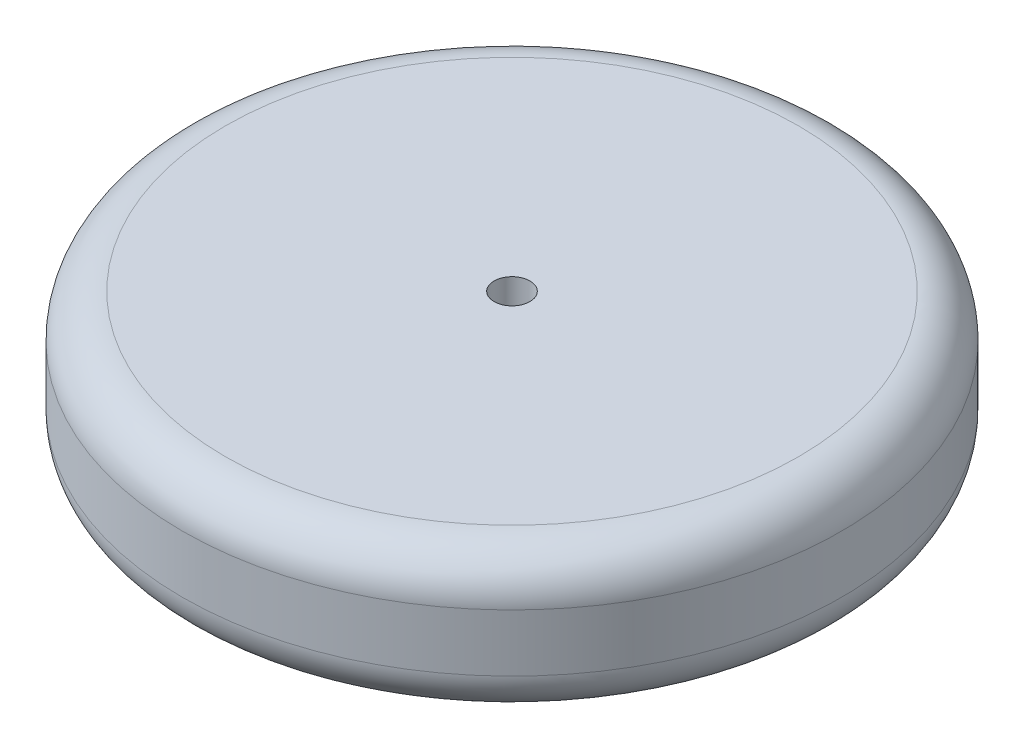
ISO-10303-21;
HEADER;
FILE_DESCRIPTION(('STEP AP214'),'2;1');
FILE_NAME('part.step','',(''),(''),'','','');
FILE_SCHEMA(('AUTOMOTIVE_DESIGN { 1 0 10303 214 1 1 1 1 }'));
ENDSEC;
DATA;
#1=APPLICATION_CONTEXT('core data for automotive mechanical design processes');
#2=APPLICATION_PROTOCOL_DEFINITION('international standard','automotive_design',2000,#1);
#3=PRODUCT_CONTEXT('',#1,'mechanical');
#4=PRODUCT('Part','Part','',(#3));
#5=PRODUCT_RELATED_PRODUCT_CATEGORY('part','',(#4));
#6=PRODUCT_DEFINITION_FORMATION('','',#4);
#7=PRODUCT_DEFINITION_CONTEXT('part definition',#1,'design');
#8=PRODUCT_DEFINITION('design','',#6,#7);
#9=PRODUCT_DEFINITION_SHAPE('','',#8);
#10=(LENGTH_UNIT() NAMED_UNIT(*) SI_UNIT(.MILLI.,.METRE.));
#11=(NAMED_UNIT(*) PLANE_ANGLE_UNIT() SI_UNIT($,.RADIAN.));
#12=(NAMED_UNIT(*) SI_UNIT($,.STERADIAN.) SOLID_ANGLE_UNIT());
#13=UNCERTAINTY_MEASURE_WITH_UNIT(LENGTH_MEASURE(1.E-05),#10,'distance_accuracy_value','');
#14=(GEOMETRIC_REPRESENTATION_CONTEXT(3) GLOBAL_UNCERTAINTY_ASSIGNED_CONTEXT((#13)) GLOBAL_UNIT_ASSIGNED_CONTEXT((#10,
#11,#12)) REPRESENTATION_CONTEXT('',''));
#15=CARTESIAN_POINT('',(0.,0.,0.));
#16=DIRECTION('',(0.,0.,1.));
#17=DIRECTION('',(1.,0.,0.));
#18=AXIS2_PLACEMENT_3D('',#15,#16,#17);
#19=CARTESIAN_POINT('',(0.,127.,0.));
#20=DIRECTION('',(0.,-1.,0.));
#21=DIRECTION('',(0.,0.,-1.));
#22=AXIS2_PLACEMENT_3D('',#19,#20,#21);
#23=CYLINDRICAL_SURFACE('',#22,292.1);
#24=CARTESIAN_POINT('',(0.,38.1,0.));
#25=DIRECTION('',(0.,1.,0.));
#26=DIRECTION('',(0.,0.,1.));
#27=AXIS2_PLACEMENT_3D('',#24,#25,#26);
#28=CIRCLE('',#27,292.1);
#29=CARTESIAN_POINT('',(0.,38.1,292.1));
#30=VERTEX_POINT('',#29);
#31=EDGE_CURVE('E59',#30,#30,#28,.T.);
#32=ORIENTED_EDGE('',*,*,#31,.T.);
#33=EDGE_LOOP('',(#32));
#34=FACE_BOUND('',#33,.T.);
#35=CARTESIAN_POINT('',(0.,88.9,0.));
#36=DIRECTION('',(0.,1.,0.));
#37=DIRECTION('',(0.,0.,1.));
#38=AXIS2_PLACEMENT_3D('',#35,#36,#37);
#39=CIRCLE('',#38,292.1);
#40=CARTESIAN_POINT('',(0.,88.9,292.1));
#41=VERTEX_POINT('',#40);
#42=EDGE_CURVE('E63',#41,#41,#39,.F.);
#43=ORIENTED_EDGE('',*,*,#42,.T.);
#44=EDGE_LOOP('',(#43));
#45=FACE_BOUND('',#44,.T.);
#46=ADVANCED_FACE('F48',(#34,#45),#23,.T.);
#47=CARTESIAN_POINT('',(0.,127.,0.));
#48=DIRECTION('',(0.,1.,0.));
#49=DIRECTION('',(0.,0.,1.));
#50=AXIS2_PLACEMENT_3D('',#47,#48,#49);
#51=PLANE('',#50);
#52=CARTESIAN_POINT('',(0.,127.,0.));
#53=DIRECTION('',(0.,1.,0.));
#54=DIRECTION('',(0.,0.,1.));
#55=AXIS2_PLACEMENT_3D('',#52,#53,#54);
#56=CIRCLE('',#55,15.875);
#57=CARTESIAN_POINT('',(0.,127.,15.875));
#58=VERTEX_POINT('',#57);
#59=EDGE_CURVE('E69',#58,#58,#56,.T.);
#60=ORIENTED_EDGE('',*,*,#59,.F.);
#61=EDGE_LOOP('',(#60));
#62=FACE_BOUND('',#61,.T.);
#63=CARTESIAN_POINT('',(0.,127.,0.));
#64=DIRECTION('',(0.,1.,0.));
#65=DIRECTION('',(0.,0.,1.));
#66=AXIS2_PLACEMENT_3D('',#63,#64,#65);
#67=CIRCLE('',#66,254.);
#68=CARTESIAN_POINT('',(0.,127.,254.));
#69=VERTEX_POINT('',#68);
#70=EDGE_CURVE('E12',#69,#69,#67,.T.);
#71=ORIENTED_EDGE('',*,*,#70,.T.);
#72=EDGE_LOOP('',(#71));
#73=FACE_BOUND('',#72,.T.);
#74=ADVANCED_FACE('F83',(#62,#73),#51,.T.);
#75=CARTESIAN_POINT('',(0.,0.,0.));
#76=DIRECTION('',(0.,1.,0.));
#77=DIRECTION('',(0.,0.,1.));
#78=AXIS2_PLACEMENT_3D('',#75,#76,#77);
#79=PLANE('',#78);
#80=CARTESIAN_POINT('',(0.,0.,0.));
#81=DIRECTION('',(0.,1.,0.));
#82=DIRECTION('',(0.,0.,1.));
#83=AXIS2_PLACEMENT_3D('',#80,#81,#82);
#84=CIRCLE('',#83,15.875);
#85=CARTESIAN_POINT('',(0.,0.,15.875));
#86=VERTEX_POINT('',#85);
#87=EDGE_CURVE('E68',#86,#86,#84,.T.);
#88=ORIENTED_EDGE('',*,*,#87,.T.);
#89=EDGE_LOOP('',(#88));
#90=FACE_BOUND('',#89,.T.);
#91=CARTESIAN_POINT('',(0.,0.,0.));
#92=DIRECTION('',(0.,1.,0.));
#93=DIRECTION('',(0.,0.,1.));
#94=AXIS2_PLACEMENT_3D('',#91,#92,#93);
#95=CIRCLE('',#94,254.);
#96=CARTESIAN_POINT('',(0.,0.,254.));
#97=VERTEX_POINT('',#96);
#98=EDGE_CURVE('E55',#97,#97,#95,.F.);
#99=ORIENTED_EDGE('',*,*,#98,.T.);
#100=EDGE_LOOP('',(#99));
#101=FACE_BOUND('',#100,.T.);
#102=ADVANCED_FACE('F75',(#90,#101),#79,.F.);
#103=CARTESIAN_POINT('',(0.,38.1,0.));
#104=DIRECTION('',(0.,1.,0.));
#105=DIRECTION('',(0.,0.,1.));
#106=AXIS2_PLACEMENT_3D('',#103,#104,#105);
#107=TOROIDAL_SURFACE('',#106,254.,38.1);
#108=ORIENTED_EDGE('',*,*,#98,.F.);
#109=EDGE_LOOP('',(#108));
#110=FACE_BOUND('',#109,.T.);
#111=ORIENTED_EDGE('',*,*,#31,.F.);
#112=EDGE_LOOP('',(#111));
#113=FACE_BOUND('',#112,.T.);
#114=ADVANCED_FACE('F90',(#110,#113),#107,.T.);
#115=CARTESIAN_POINT('',(0.,88.9,0.));
#116=DIRECTION('',(0.,1.,0.));
#117=DIRECTION('',(0.,0.,1.));
#118=AXIS2_PLACEMENT_3D('',#115,#116,#117);
#119=TOROIDAL_SURFACE('',#118,254.,38.1);
#120=ORIENTED_EDGE('',*,*,#42,.F.);
#121=EDGE_LOOP('',(#120));
#122=FACE_BOUND('',#121,.T.);
#123=ORIENTED_EDGE('',*,*,#70,.F.);
#124=EDGE_LOOP('',(#123));
#125=FACE_BOUND('',#124,.T.);
#126=ADVANCED_FACE('F50',(#122,#125),#119,.T.);
#127=CARTESIAN_POINT('',(0.,0.,0.));
#128=DIRECTION('',(0.,1.,0.));
#129=DIRECTION('',(0.,0.,1.));
#130=AXIS2_PLACEMENT_3D('',#127,#128,#129);
#131=CYLINDRICAL_SURFACE('',#130,15.875);
#132=ORIENTED_EDGE('',*,*,#87,.F.);
#133=EDGE_LOOP('',(#132));
#134=FACE_BOUND('',#133,.T.);
#135=ORIENTED_EDGE('',*,*,#59,.T.);
#136=EDGE_LOOP('',(#135));
#137=FACE_BOUND('',#136,.T.);
#138=ADVANCED_FACE('F77',(#134,#137),#131,.F.);
#139=CLOSED_SHELL('',(#46,#74,#102,#114,#126,#138));
#140=MANIFOLD_SOLID_BREP('B2',#139);
#141=ADVANCED_BREP_SHAPE_REPRESENTATION('',(#18,#140),#14);
#142=SHAPE_DEFINITION_REPRESENTATION(#9,#141);
ENDSEC;
END-ISO-10303-21;
